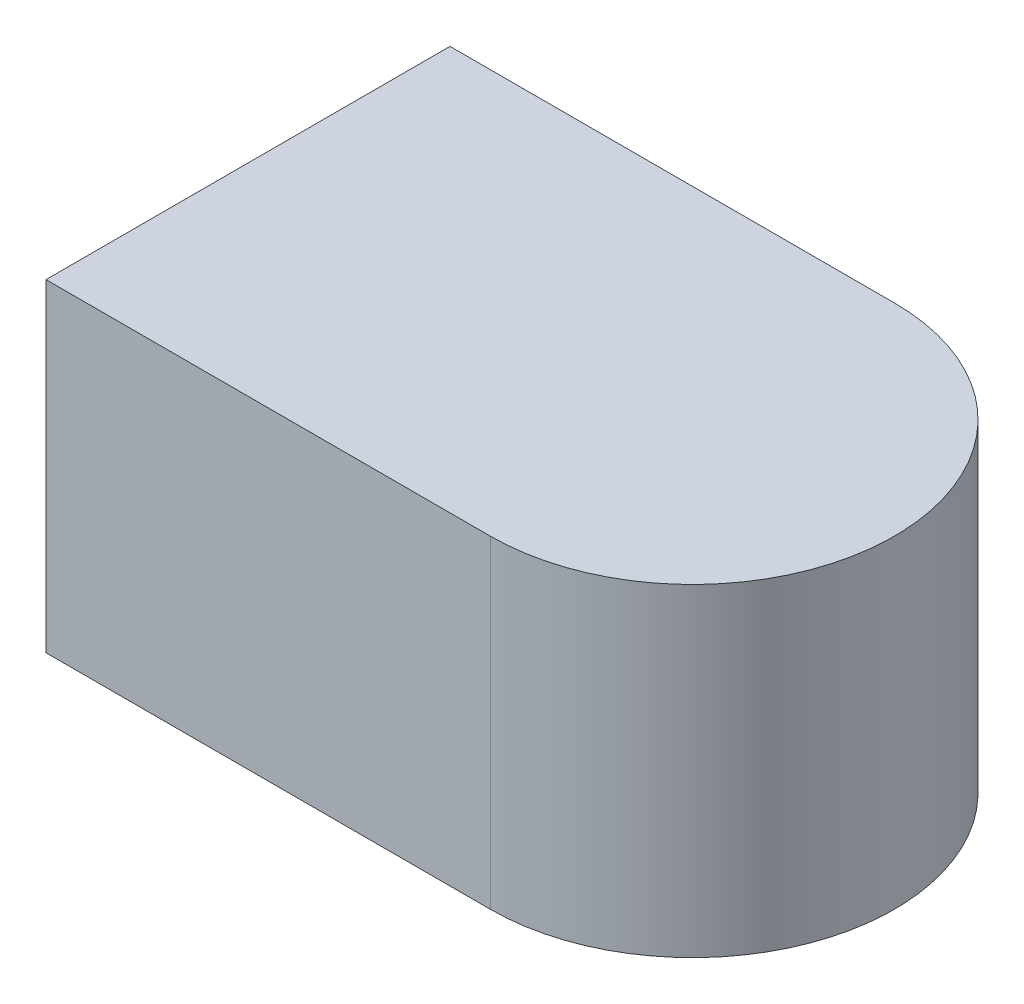
ISO-10303-21;
HEADER;
FILE_DESCRIPTION(('STEP AP214'),'2;1');
FILE_NAME('part.step','',(''),(''),'','','');
FILE_SCHEMA(('AUTOMOTIVE_DESIGN { 1 0 10303 214 1 1 1 1 }'));
ENDSEC;
DATA;
#1=APPLICATION_CONTEXT('core data for automotive mechanical design processes');
#2=APPLICATION_PROTOCOL_DEFINITION('international standard','automotive_design',2000,#1);
#3=PRODUCT_CONTEXT('',#1,'mechanical');
#4=PRODUCT('Part','Part','',(#3));
#5=PRODUCT_RELATED_PRODUCT_CATEGORY('part','',(#4));
#6=PRODUCT_DEFINITION_FORMATION('','',#4);
#7=PRODUCT_DEFINITION_CONTEXT('part definition',#1,'design');
#8=PRODUCT_DEFINITION('design','',#6,#7);
#9=PRODUCT_DEFINITION_SHAPE('','',#8);
#10=(LENGTH_UNIT() NAMED_UNIT(*) SI_UNIT(.MILLI.,.METRE.));
#11=(NAMED_UNIT(*) PLANE_ANGLE_UNIT() SI_UNIT($,.RADIAN.));
#12=(NAMED_UNIT(*) SI_UNIT($,.STERADIAN.) SOLID_ANGLE_UNIT());
#13=UNCERTAINTY_MEASURE_WITH_UNIT(LENGTH_MEASURE(1.E-05),#10,'distance_accuracy_value','');
#14=(GEOMETRIC_REPRESENTATION_CONTEXT(3) GLOBAL_UNCERTAINTY_ASSIGNED_CONTEXT((#13)) GLOBAL_UNIT_ASSIGNED_CONTEXT((#10,
#11,#12)) REPRESENTATION_CONTEXT('',''));
#15=CARTESIAN_POINT('',(0.,0.,0.));
#16=DIRECTION('',(0.,0.,1.));
#17=DIRECTION('',(1.,0.,0.));
#18=AXIS2_PLACEMENT_3D('',#15,#16,#17);
#19=CARTESIAN_POINT('',(0.,0.,0.));
#20=DIRECTION('',(0.,-1.,0.));
#21=DIRECTION('',(-1.,0.,0.));
#22=AXIS2_PLACEMENT_3D('',#19,#20,#21);
#23=PLANE('',#22);
#24=CARTESIAN_POINT('',(-1.225,0.,0.75));
#25=DIRECTION('',(0.,-1.,0.));
#26=DIRECTION('',(0.,0.,-1.));
#27=AXIS2_PLACEMENT_3D('',#24,#25,#26);
#28=CIRCLE('',#27,0.125);
#29=CARTESIAN_POINT('',(-1.225,0.,0.625));
#30=VERTEX_POINT('',#29);
#31=CARTESIAN_POINT('',(-1.225,0.,0.875));
#32=VERTEX_POINT('',#31);
#33=EDGE_CURVE('E11',#30,#32,#28,.T.);
#34=ORIENTED_EDGE('',*,*,#33,.T.);
#35=DIRECTION('',(-1.,0.,0.));
#36=VECTOR('',#35,1.);
#37=CARTESIAN_POINT('',(-1.225,0.,0.875));
#38=LINE('',#37,#36);
#39=CARTESIAN_POINT('',(-1.5,0.,0.875));
#40=VERTEX_POINT('',#39);
#41=EDGE_CURVE('E24',#32,#40,#38,.T.);
#42=ORIENTED_EDGE('',*,*,#41,.T.);
#43=DIRECTION('',(0.,0.,-1.));
#44=VECTOR('',#43,1.);
#45=CARTESIAN_POINT('',(-1.5,0.,0.875));
#46=LINE('',#45,#44);
#47=CARTESIAN_POINT('',(-1.5,0.,0.625));
#48=VERTEX_POINT('',#47);
#49=EDGE_CURVE('E62',#40,#48,#46,.T.);
#50=ORIENTED_EDGE('',*,*,#49,.T.);
#51=DIRECTION('',(1.,0.,0.));
#52=VECTOR('',#51,1.);
#53=CARTESIAN_POINT('',(-1.5,0.,0.625));
#54=LINE('',#53,#52);
#55=EDGE_CURVE('E36',#48,#30,#54,.T.);
#56=ORIENTED_EDGE('',*,*,#55,.T.);
#57=EDGE_LOOP('',(#34,#42,#50,#56));
#58=FACE_BOUND('',#57,.T.);
#59=ADVANCED_FACE('F17',(#58),#23,.T.);
#60=CARTESIAN_POINT('',(-1.5,0.,0.625));
#61=DIRECTION('',(0.,0.,1.));
#62=DIRECTION('',(1.,0.,0.));
#63=AXIS2_PLACEMENT_3D('',#60,#61,#62);
#64=PLANE('',#63);
#65=DIRECTION('',(0.,1.,0.));
#66=VECTOR('',#65,1.);
#67=CARTESIAN_POINT('',(-1.5,0.,0.625));
#68=LINE('',#67,#66);
#69=CARTESIAN_POINT('',(-1.5,0.2,0.625));
#70=VERTEX_POINT('',#69);
#71=EDGE_CURVE('E84',#48,#70,#68,.T.);
#72=ORIENTED_EDGE('',*,*,#71,.T.);
#73=DIRECTION('',(1.,0.,0.));
#74=VECTOR('',#73,1.);
#75=CARTESIAN_POINT('',(-1.5,0.2,0.625));
#76=LINE('',#75,#74);
#77=CARTESIAN_POINT('',(-1.225,0.2,0.625));
#78=VERTEX_POINT('',#77);
#79=EDGE_CURVE('E74',#70,#78,#76,.T.);
#80=ORIENTED_EDGE('',*,*,#79,.T.);
#81=DIRECTION('',(0.,1.,0.));
#82=VECTOR('',#81,1.);
#83=CARTESIAN_POINT('',(-1.225,0.,0.625));
#84=LINE('',#83,#82);
#85=EDGE_CURVE('E81',#30,#78,#84,.T.);
#86=ORIENTED_EDGE('',*,*,#85,.F.);
#87=ORIENTED_EDGE('',*,*,#55,.F.);
#88=EDGE_LOOP('',(#72,#80,#86,#87));
#89=FACE_BOUND('',#88,.T.);
#90=ADVANCED_FACE('F91',(#89),#64,.F.);
#91=CARTESIAN_POINT('',(-1.225,0.,0.75));
#92=DIRECTION('',(0.,-1.,0.));
#93=DIRECTION('',(-1.,0.,0.));
#94=AXIS2_PLACEMENT_3D('',#91,#92,#93);
#95=CYLINDRICAL_SURFACE('',#94,0.125);
#96=ORIENTED_EDGE('',*,*,#85,.T.);
#97=CARTESIAN_POINT('',(-1.225,0.2,0.75));
#98=DIRECTION('',(0.,-1.,0.));
#99=DIRECTION('',(0.,0.,-1.));
#100=AXIS2_PLACEMENT_3D('',#97,#98,#99);
#101=CIRCLE('',#100,0.125);
#102=CARTESIAN_POINT('',(-1.225,0.2,0.875));
#103=VERTEX_POINT('',#102);
#104=EDGE_CURVE('E79',#78,#103,#101,.T.);
#105=ORIENTED_EDGE('',*,*,#104,.T.);
#106=DIRECTION('',(0.,1.,0.));
#107=VECTOR('',#106,1.);
#108=CARTESIAN_POINT('',(-1.225,0.,0.875));
#109=LINE('',#108,#107);
#110=EDGE_CURVE('E68',#32,#103,#109,.T.);
#111=ORIENTED_EDGE('',*,*,#110,.F.);
#112=ORIENTED_EDGE('',*,*,#33,.F.);
#113=EDGE_LOOP('',(#96,#105,#111,#112));
#114=FACE_BOUND('',#113,.T.);
#115=ADVANCED_FACE('F89',(#114),#95,.T.);
#116=CARTESIAN_POINT('',(-1.225,0.,0.875));
#117=DIRECTION('',(0.,0.,-1.));
#118=DIRECTION('',(-1.,0.,0.));
#119=AXIS2_PLACEMENT_3D('',#116,#117,#118);
#120=PLANE('',#119);
#121=ORIENTED_EDGE('',*,*,#110,.T.);
#122=DIRECTION('',(-1.,0.,0.));
#123=VECTOR('',#122,1.);
#124=CARTESIAN_POINT('',(-1.225,0.2,0.875));
#125=LINE('',#124,#123);
#126=CARTESIAN_POINT('',(-1.5,0.2,0.875));
#127=VERTEX_POINT('',#126);
#128=EDGE_CURVE('E63',#103,#127,#125,.T.);
#129=ORIENTED_EDGE('',*,*,#128,.T.);
#130=DIRECTION('',(0.,1.,0.));
#131=VECTOR('',#130,1.);
#132=CARTESIAN_POINT('',(-1.5,0.,0.875));
#133=LINE('',#132,#131);
#134=EDGE_CURVE('E56',#40,#127,#133,.T.);
#135=ORIENTED_EDGE('',*,*,#134,.F.);
#136=ORIENTED_EDGE('',*,*,#41,.F.);
#137=EDGE_LOOP('',(#121,#129,#135,#136));
#138=FACE_BOUND('',#137,.T.);
#139=ADVANCED_FACE('F66',(#138),#120,.F.);
#140=CARTESIAN_POINT('',(-1.5,0.,0.875));
#141=DIRECTION('',(1.,0.,0.));
#142=DIRECTION('',(0.,0.,-1.));
#143=AXIS2_PLACEMENT_3D('',#140,#141,#142);
#144=PLANE('',#143);
#145=ORIENTED_EDGE('',*,*,#134,.T.);
#146=DIRECTION('',(0.,0.,-1.));
#147=VECTOR('',#146,1.);
#148=CARTESIAN_POINT('',(-1.5,0.2,0.875));
#149=LINE('',#148,#147);
#150=EDGE_CURVE('E61',#127,#70,#149,.T.);
#151=ORIENTED_EDGE('',*,*,#150,.T.);
#152=ORIENTED_EDGE('',*,*,#71,.F.);
#153=ORIENTED_EDGE('',*,*,#49,.F.);
#154=EDGE_LOOP('',(#145,#151,#152,#153));
#155=FACE_BOUND('',#154,.T.);
#156=ADVANCED_FACE('F58',(#155),#144,.F.);
#157=CARTESIAN_POINT('',(0.,0.2,0.));
#158=DIRECTION('',(0.,-1.,0.));
#159=DIRECTION('',(-1.,0.,0.));
#160=AXIS2_PLACEMENT_3D('',#157,#158,#159);
#161=PLANE('',#160);
#162=ORIENTED_EDGE('',*,*,#150,.F.);
#163=ORIENTED_EDGE('',*,*,#128,.F.);
#164=ORIENTED_EDGE('',*,*,#104,.F.);
#165=ORIENTED_EDGE('',*,*,#79,.F.);
#166=EDGE_LOOP('',(#162,#163,#164,#165));
#167=FACE_BOUND('',#166,.T.);
#168=ADVANCED_FACE('F72',(#167),#161,.F.);
#169=CLOSED_SHELL('',(#59,#90,#115,#139,#156,#168));
#170=MANIFOLD_SOLID_BREP('B1',#169);
#171=ADVANCED_BREP_SHAPE_REPRESENTATION('',(#18,#170),#14);
#172=SHAPE_DEFINITION_REPRESENTATION(#9,#171);
ENDSEC;
END-ISO-10303-21;
